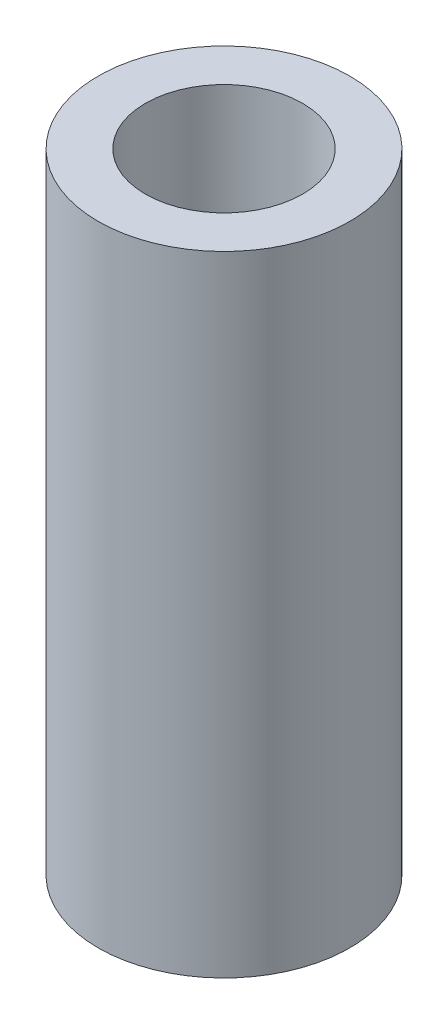
ISO-10303-21;
HEADER;
FILE_DESCRIPTION(('STEP AP214'),'2;1');
FILE_NAME('part.step','',(''),(''),'','','');
FILE_SCHEMA(('AUTOMOTIVE_DESIGN { 1 0 10303 214 1 1 1 1 }'));
ENDSEC;
DATA;
#1=APPLICATION_CONTEXT('core data for automotive mechanical design processes');
#2=APPLICATION_PROTOCOL_DEFINITION('international standard','automotive_design',2000,#1);
#3=PRODUCT_CONTEXT('',#1,'mechanical');
#4=PRODUCT('Part','Part','',(#3));
#5=PRODUCT_RELATED_PRODUCT_CATEGORY('part','',(#4));
#6=PRODUCT_DEFINITION_FORMATION('','',#4);
#7=PRODUCT_DEFINITION_CONTEXT('part definition',#1,'design');
#8=PRODUCT_DEFINITION('design','',#6,#7);
#9=PRODUCT_DEFINITION_SHAPE('','',#8);
#10=(LENGTH_UNIT() NAMED_UNIT(*) SI_UNIT(.MILLI.,.METRE.));
#11=(NAMED_UNIT(*) PLANE_ANGLE_UNIT() SI_UNIT($,.RADIAN.));
#12=(NAMED_UNIT(*) SI_UNIT($,.STERADIAN.) SOLID_ANGLE_UNIT());
#13=UNCERTAINTY_MEASURE_WITH_UNIT(LENGTH_MEASURE(1.E-05),#10,'distance_accuracy_value','');
#14=(GEOMETRIC_REPRESENTATION_CONTEXT(3) GLOBAL_UNCERTAINTY_ASSIGNED_CONTEXT((#13)) GLOBAL_UNIT_ASSIGNED_CONTEXT((#10,
#11,#12)) REPRESENTATION_CONTEXT('',''));
#15=CARTESIAN_POINT('',(0.,0.,0.));
#16=DIRECTION('',(0.,0.,1.));
#17=DIRECTION('',(1.,0.,0.));
#18=AXIS2_PLACEMENT_3D('',#15,#16,#17);
#19=CARTESIAN_POINT('',(0.,20.,0.));
#20=DIRECTION('',(0.,1.,0.));
#21=DIRECTION('',(0.,0.,1.));
#22=AXIS2_PLACEMENT_3D('',#19,#20,#21);
#23=PLANE('',#22);
#24=CARTESIAN_POINT('',(0.,20.,0.));
#25=DIRECTION('',(0.,1.,0.));
#26=DIRECTION('',(0.,0.,1.));
#27=AXIS2_PLACEMENT_3D('',#24,#25,#26);
#28=CIRCLE('',#27,4.);
#29=CARTESIAN_POINT('',(0.,20.,4.));
#30=VERTEX_POINT('',#29);
#31=EDGE_CURVE('E10',#30,#30,#28,.T.);
#32=ORIENTED_EDGE('',*,*,#31,.T.);
#33=EDGE_LOOP('',(#32));
#34=FACE_BOUND('',#33,.T.);
#35=CARTESIAN_POINT('',(0.,20.,0.));
#36=DIRECTION('',(0.,1.,0.));
#37=DIRECTION('',(0.,0.,1.));
#38=AXIS2_PLACEMENT_3D('',#35,#36,#37);
#39=CIRCLE('',#38,2.5);
#40=CARTESIAN_POINT('',(0.,20.,2.5));
#41=VERTEX_POINT('',#40);
#42=EDGE_CURVE('E50',#41,#41,#39,.T.);
#43=ORIENTED_EDGE('',*,*,#42,.F.);
#44=EDGE_LOOP('',(#43));
#45=FACE_BOUND('',#44,.T.);
#46=ADVANCED_FACE('F37',(#34,#45),#23,.T.);
#47=CARTESIAN_POINT('',(0.,0.,0.));
#48=DIRECTION('',(0.,1.,0.));
#49=DIRECTION('',(0.,0.,1.));
#50=AXIS2_PLACEMENT_3D('',#47,#48,#49);
#51=PLANE('',#50);
#52=CARTESIAN_POINT('',(0.,0.,0.));
#53=DIRECTION('',(0.,1.,0.));
#54=DIRECTION('',(0.,0.,1.));
#55=AXIS2_PLACEMENT_3D('',#52,#53,#54);
#56=CIRCLE('',#55,4.);
#57=CARTESIAN_POINT('',(0.,0.,4.));
#58=VERTEX_POINT('',#57);
#59=EDGE_CURVE('E41',#58,#58,#56,.T.);
#60=ORIENTED_EDGE('',*,*,#59,.F.);
#61=EDGE_LOOP('',(#60));
#62=FACE_BOUND('',#61,.T.);
#63=CARTESIAN_POINT('',(0.,0.,0.));
#64=DIRECTION('',(0.,1.,0.));
#65=DIRECTION('',(0.,0.,1.));
#66=AXIS2_PLACEMENT_3D('',#63,#64,#65);
#67=CIRCLE('',#66,2.5);
#68=CARTESIAN_POINT('',(0.,0.,2.5));
#69=VERTEX_POINT('',#68);
#70=EDGE_CURVE('E52',#69,#69,#67,.T.);
#71=ORIENTED_EDGE('',*,*,#70,.T.);
#72=EDGE_LOOP('',(#71));
#73=FACE_BOUND('',#72,.T.);
#74=ADVANCED_FACE('F64',(#62,#73),#51,.F.);
#75=CARTESIAN_POINT('',(0.,20.,0.));
#76=DIRECTION('',(0.,-1.,0.));
#77=DIRECTION('',(0.,0.,-1.));
#78=AXIS2_PLACEMENT_3D('',#75,#76,#77);
#79=CYLINDRICAL_SURFACE('',#78,4.);
#80=ORIENTED_EDGE('',*,*,#31,.F.);
#81=EDGE_LOOP('',(#80));
#82=FACE_BOUND('',#81,.T.);
#83=ORIENTED_EDGE('',*,*,#59,.T.);
#84=EDGE_LOOP('',(#83));
#85=FACE_BOUND('',#84,.T.);
#86=ADVANCED_FACE('F39',(#82,#85),#79,.T.);
#87=CARTESIAN_POINT('',(0.,20.,0.));
#88=DIRECTION('',(0.,-1.,0.));
#89=DIRECTION('',(0.,0.,-1.));
#90=AXIS2_PLACEMENT_3D('',#87,#88,#89);
#91=CYLINDRICAL_SURFACE('',#90,2.5);
#92=ORIENTED_EDGE('',*,*,#42,.T.);
#93=EDGE_LOOP('',(#92));
#94=FACE_BOUND('',#93,.T.);
#95=ORIENTED_EDGE('',*,*,#70,.F.);
#96=EDGE_LOOP('',(#95));
#97=FACE_BOUND('',#96,.T.);
#98=ADVANCED_FACE('F60',(#94,#97),#91,.F.);
#99=CLOSED_SHELL('',(#46,#74,#86,#98));
#100=MANIFOLD_SOLID_BREP('B2',#99);
#101=ADVANCED_BREP_SHAPE_REPRESENTATION('',(#18,#100),#14);
#102=SHAPE_DEFINITION_REPRESENTATION(#9,#101);
ENDSEC;
END-ISO-10303-21;
